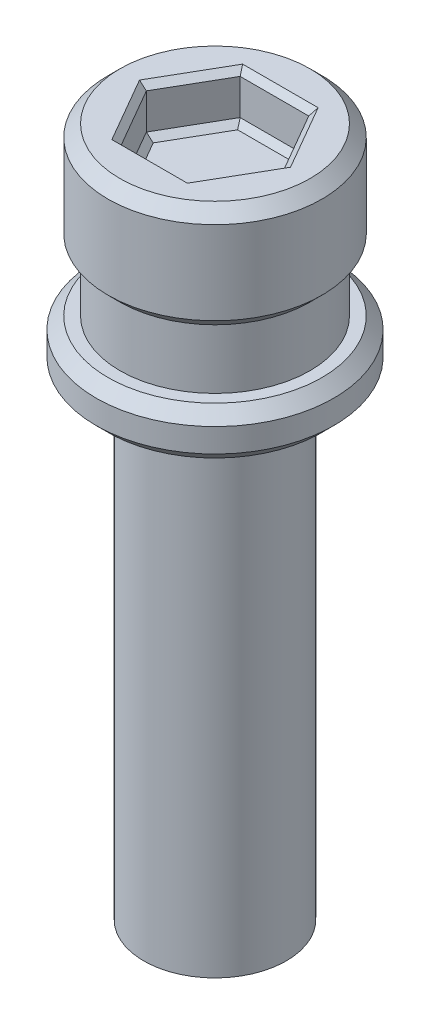
ISO-10303-21;
HEADER;
FILE_DESCRIPTION(('STEP AP214'),'2;1');
FILE_NAME('part.step','',(''),(''),'','','');
FILE_SCHEMA(('AUTOMOTIVE_DESIGN { 1 0 10303 214 1 1 1 1 }'));
ENDSEC;
DATA;
#1=APPLICATION_CONTEXT('core data for automotive mechanical design processes');
#2=APPLICATION_PROTOCOL_DEFINITION('international standard','automotive_design',2000,#1);
#3=PRODUCT_CONTEXT('',#1,'mechanical');
#4=PRODUCT('Part','Part','',(#3));
#5=PRODUCT_RELATED_PRODUCT_CATEGORY('part','',(#4));
#6=PRODUCT_DEFINITION_FORMATION('','',#4);
#7=PRODUCT_DEFINITION_CONTEXT('part definition',#1,'design');
#8=PRODUCT_DEFINITION('design','',#6,#7);
#9=PRODUCT_DEFINITION_SHAPE('','',#8);
#10=(LENGTH_UNIT() NAMED_UNIT(*) SI_UNIT(.MILLI.,.METRE.));
#11=(NAMED_UNIT(*) PLANE_ANGLE_UNIT() SI_UNIT($,.RADIAN.));
#12=(NAMED_UNIT(*) SI_UNIT($,.STERADIAN.) SOLID_ANGLE_UNIT());
#13=UNCERTAINTY_MEASURE_WITH_UNIT(LENGTH_MEASURE(1.E-05),#10,'distance_accuracy_value','');
#14=(GEOMETRIC_REPRESENTATION_CONTEXT(3) GLOBAL_UNCERTAINTY_ASSIGNED_CONTEXT((#13)) GLOBAL_UNIT_ASSIGNED_CONTEXT((#10,
#11,#12)) REPRESENTATION_CONTEXT('',''));
#15=CARTESIAN_POINT('',(0.,0.,0.));
#16=DIRECTION('',(0.,0.,1.));
#17=DIRECTION('',(1.,0.,0.));
#18=AXIS2_PLACEMENT_3D('',#15,#16,#17);
#19=CARTESIAN_POINT('',(0.,4.5,0.));
#20=DIRECTION('',(0.,-1.,0.));
#21=DIRECTION('',(0.,0.,-1.));
#22=AXIS2_PLACEMENT_3D('',#19,#20,#21);
#23=CYLINDRICAL_SURFACE('',#22,4.5);
#24=CARTESIAN_POINT('',(0.,0.500000000000001,0.));
#25=DIRECTION('',(0.,1.,0.));
#26=DIRECTION('',(0.,0.,1.));
#27=AXIS2_PLACEMENT_3D('',#24,#25,#26);
#28=CIRCLE('',#27,4.5);
#29=CARTESIAN_POINT('',(0.,0.500000000000001,4.5));
#30=VERTEX_POINT('',#29);
#31=EDGE_CURVE('E264',#30,#30,#28,.T.);
#32=ORIENTED_EDGE('',*,*,#31,.T.);
#33=EDGE_LOOP('',(#32));
#34=FACE_BOUND('',#33,.T.);
#35=CARTESIAN_POINT('',(0.,3.99999999999999,0.));
#36=DIRECTION('',(0.,1.,0.));
#37=DIRECTION('',(0.,0.,1.));
#38=AXIS2_PLACEMENT_3D('',#35,#36,#37);
#39=CIRCLE('',#38,4.5);
#40=CARTESIAN_POINT('',(0.,3.99999999999999,4.5));
#41=VERTEX_POINT('',#40);
#42=EDGE_CURVE('E261',#41,#41,#39,.F.);
#43=ORIENTED_EDGE('',*,*,#42,.T.);
#44=EDGE_LOOP('',(#43));
#45=FACE_BOUND('',#44,.T.);
#46=ADVANCED_FACE('F33',(#34,#45),#23,.T.);
#47=CARTESIAN_POINT('',(0.,4.5,0.));
#48=DIRECTION('',(0.,1.,0.));
#49=DIRECTION('',(0.,0.,1.));
#50=AXIS2_PLACEMENT_3D('',#47,#48,#49);
#51=PLANE('',#50);
#52=DIRECTION('',(-0.5,0.,0.866025403784439));
#53=VECTOR('',#52,1.);
#54=CARTESIAN_POINT('',(1.65988202392017,4.5,2.625));
#55=LINE('',#54,#53);
#56=CARTESIAN_POINT('',(3.17542648054294,4.5,0.));
#57=VERTEX_POINT('',#56);
#58=CARTESIAN_POINT('',(1.58771324027147,4.5,2.75));
#59=VERTEX_POINT('',#58);
#60=EDGE_CURVE('E166',#57,#59,#55,.T.);
#61=ORIENTED_EDGE('',*,*,#60,.T.);
#62=DIRECTION('',(-1.,0.,0.));
#63=VECTOR('',#62,1.);
#64=CARTESIAN_POINT('',(-1.44337567297407,4.5,2.75));
#65=LINE('',#64,#63);
#66=CARTESIAN_POINT('',(-1.58771324027147,4.5,2.75));
#67=VERTEX_POINT('',#66);
#68=EDGE_CURVE('E182',#59,#67,#65,.T.);
#69=ORIENTED_EDGE('',*,*,#68,.T.);
#70=DIRECTION('',(-0.5,0.,-0.866025403784439));
#71=VECTOR('',#70,1.);
#72=CARTESIAN_POINT('',(-3.10325769689424,4.5,0.125));
#73=LINE('',#72,#71);
#74=CARTESIAN_POINT('',(-3.17542648054294,4.5,0.));
#75=VERTEX_POINT('',#74);
#76=EDGE_CURVE('E180',#67,#75,#73,.T.);
#77=ORIENTED_EDGE('',*,*,#76,.T.);
#78=DIRECTION('',(0.5,0.,-0.866025403784439));
#79=VECTOR('',#78,1.);
#80=CARTESIAN_POINT('',(-1.65988202392017,4.5,-2.625));
#81=LINE('',#80,#79);
#82=CARTESIAN_POINT('',(-1.58771324027147,4.5,-2.75));
#83=VERTEX_POINT('',#82);
#84=EDGE_CURVE('E178',#75,#83,#81,.T.);
#85=ORIENTED_EDGE('',*,*,#84,.T.);
#86=DIRECTION('',(1.,0.,0.));
#87=VECTOR('',#86,1.);
#88=CARTESIAN_POINT('',(1.44337567297406,4.5,-2.75));
#89=LINE('',#88,#87);
#90=CARTESIAN_POINT('',(1.58771324027147,4.5,-2.75));
#91=VERTEX_POINT('',#90);
#92=EDGE_CURVE('E176',#83,#91,#89,.T.);
#93=ORIENTED_EDGE('',*,*,#92,.T.);
#94=DIRECTION('',(0.5,0.,0.866025403784439));
#95=VECTOR('',#94,1.);
#96=CARTESIAN_POINT('',(3.10325769689424,4.5,-0.124999999999999));
#97=LINE('',#96,#95);
#98=EDGE_CURVE('E174',#91,#57,#97,.T.);
#99=ORIENTED_EDGE('',*,*,#98,.T.);
#100=EDGE_LOOP('',(#61,#69,#77,#85,#93,#99));
#101=FACE_BOUND('',#100,.T.);
#102=CARTESIAN_POINT('',(0.,4.5,0.));
#103=DIRECTION('',(0.,1.,0.));
#104=DIRECTION('',(0.,0.,1.));
#105=AXIS2_PLACEMENT_3D('',#102,#103,#104);
#106=CIRCLE('',#105,4.);
#107=CARTESIAN_POINT('',(0.,4.5,4.));
#108=VERTEX_POINT('',#107);
#109=EDGE_CURVE('E258',#108,#108,#106,.T.);
#110=ORIENTED_EDGE('',*,*,#109,.T.);
#111=EDGE_LOOP('',(#110));
#112=FACE_BOUND('',#111,.T.);
#113=ADVANCED_FACE('F352',(#101,#112),#51,.T.);
#114=CARTESIAN_POINT('',(1.44337567297407,2.5,2.5));
#115=DIRECTION('',(0.866025403784439,0.,0.5));
#116=DIRECTION('',(0.5,0.,-0.866025403784439));
#117=AXIS2_PLACEMENT_3D('',#114,#115,#116);
#118=PLANE('',#117);
#119=DIRECTION('',(0.,1.,0.));
#120=VECTOR('',#119,1.);
#121=CARTESIAN_POINT('',(1.44337567297407,2.5,2.5));
#122=LINE('',#121,#120);
#123=CARTESIAN_POINT('',(1.44337567297407,2.75,2.5));
#124=VERTEX_POINT('',#123);
#125=CARTESIAN_POINT('',(1.44337567297407,4.25000000000001,2.5));
#126=VERTEX_POINT('',#125);
#127=EDGE_CURVE('E130',#124,#126,#122,.T.);
#128=ORIENTED_EDGE('',*,*,#127,.T.);
#129=DIRECTION('',(0.5,0.,-0.866025403784439));
#130=VECTOR('',#129,1.);
#131=CARTESIAN_POINT('',(2.88675134594813,4.25000000000001,0.));
#132=LINE('',#131,#130);
#133=CARTESIAN_POINT('',(2.88675134594813,4.25000000000001,0.));
#134=VERTEX_POINT('',#133);
#135=EDGE_CURVE('E137',#126,#134,#132,.T.);
#136=ORIENTED_EDGE('',*,*,#135,.T.);
#137=DIRECTION('',(0.,1.,0.));
#138=VECTOR('',#137,1.);
#139=CARTESIAN_POINT('',(2.88675134594813,2.5,0.));
#140=LINE('',#139,#138);
#141=CARTESIAN_POINT('',(2.88675134594813,2.75,0.));
#142=VERTEX_POINT('',#141);
#143=EDGE_CURVE('E132',#142,#134,#140,.T.);
#144=ORIENTED_EDGE('',*,*,#143,.F.);
#145=DIRECTION('',(-0.5,0.,0.866025403784439));
#146=VECTOR('',#145,1.);
#147=CARTESIAN_POINT('',(1.44337567297407,2.75,2.5));
#148=LINE('',#147,#146);
#149=EDGE_CURVE('E127',#142,#124,#148,.T.);
#150=ORIENTED_EDGE('',*,*,#149,.T.);
#151=EDGE_LOOP('',(#128,#136,#144,#150));
#152=FACE_BOUND('',#151,.T.);
#153=ADVANCED_FACE('F129',(#152),#118,.F.);
#154=CARTESIAN_POINT('',(-1.44337567297407,2.5,2.5));
#155=DIRECTION('',(0.,0.,1.));
#156=DIRECTION('',(1.,0.,0.));
#157=AXIS2_PLACEMENT_3D('',#154,#155,#156);
#158=PLANE('',#157);
#159=DIRECTION('',(0.,1.,0.));
#160=VECTOR('',#159,1.);
#161=CARTESIAN_POINT('',(-1.44337567297407,2.5,2.5));
#162=LINE('',#161,#160);
#163=CARTESIAN_POINT('',(-1.44337567297407,2.75,2.5));
#164=VERTEX_POINT('',#163);
#165=CARTESIAN_POINT('',(-1.44337567297407,4.25000000000001,2.5));
#166=VERTEX_POINT('',#165);
#167=EDGE_CURVE('E150',#164,#166,#162,.T.);
#168=ORIENTED_EDGE('',*,*,#167,.T.);
#169=DIRECTION('',(1.,0.,0.));
#170=VECTOR('',#169,1.);
#171=CARTESIAN_POINT('',(1.44337567297407,4.25000000000001,2.5));
#172=LINE('',#171,#170);
#173=EDGE_CURVE('E148',#166,#126,#172,.T.);
#174=ORIENTED_EDGE('',*,*,#173,.T.);
#175=ORIENTED_EDGE('',*,*,#127,.F.);
#176=DIRECTION('',(-1.,0.,0.));
#177=VECTOR('',#176,1.);
#178=CARTESIAN_POINT('',(-1.44337567297407,2.75,2.5));
#179=LINE('',#178,#177);
#180=EDGE_CURVE('E145',#124,#164,#179,.T.);
#181=ORIENTED_EDGE('',*,*,#180,.T.);
#182=EDGE_LOOP('',(#168,#174,#175,#181));
#183=FACE_BOUND('',#182,.T.);
#184=ADVANCED_FACE('F143',(#183),#158,.F.);
#185=CARTESIAN_POINT('',(-2.88675134594813,2.5,0.));
#186=DIRECTION('',(-0.866025403784439,0.,0.5));
#187=DIRECTION('',(0.5,0.,0.866025403784439));
#188=AXIS2_PLACEMENT_3D('',#185,#186,#187);
#189=PLANE('',#188);
#190=DIRECTION('',(0.,1.,0.));
#191=VECTOR('',#190,1.);
#192=CARTESIAN_POINT('',(-2.88675134594813,2.5,0.));
#193=LINE('',#192,#191);
#194=CARTESIAN_POINT('',(-2.88675134594813,2.75,0.));
#195=VERTEX_POINT('',#194);
#196=CARTESIAN_POINT('',(-2.88675134594813,4.25000000000001,0.));
#197=VERTEX_POINT('',#196);
#198=EDGE_CURVE('E250',#195,#197,#193,.T.);
#199=ORIENTED_EDGE('',*,*,#198,.T.);
#200=DIRECTION('',(0.5,0.,0.866025403784439));
#201=VECTOR('',#200,1.);
#202=CARTESIAN_POINT('',(-1.44337567297407,4.25000000000001,2.5));
#203=LINE('',#202,#201);
#204=EDGE_CURVE('E187',#197,#166,#203,.T.);
#205=ORIENTED_EDGE('',*,*,#204,.T.);
#206=ORIENTED_EDGE('',*,*,#167,.F.);
#207=DIRECTION('',(-0.5,0.,-0.866025403784439));
#208=VECTOR('',#207,1.);
#209=CARTESIAN_POINT('',(-2.88675134594813,2.75,0.));
#210=LINE('',#209,#208);
#211=EDGE_CURVE('E185',#164,#195,#210,.T.);
#212=ORIENTED_EDGE('',*,*,#211,.T.);
#213=EDGE_LOOP('',(#199,#205,#206,#212));
#214=FACE_BOUND('',#213,.T.);
#215=ADVANCED_FACE('F305',(#214),#189,.F.);
#216=CARTESIAN_POINT('',(-1.44337567297407,2.5,-2.5));
#217=DIRECTION('',(-0.866025403784439,0.,-0.5));
#218=DIRECTION('',(-0.5,0.,0.866025403784439));
#219=AXIS2_PLACEMENT_3D('',#216,#217,#218);
#220=PLANE('',#219);
#221=DIRECTION('',(0.,1.,0.));
#222=VECTOR('',#221,1.);
#223=CARTESIAN_POINT('',(-1.44337567297407,2.5,-2.5));
#224=LINE('',#223,#222);
#225=CARTESIAN_POINT('',(-1.44337567297407,2.75,-2.5));
#226=VERTEX_POINT('',#225);
#227=CARTESIAN_POINT('',(-1.44337567297407,4.25000000000001,-2.5));
#228=VERTEX_POINT('',#227);
#229=EDGE_CURVE('E247',#226,#228,#224,.T.);
#230=ORIENTED_EDGE('',*,*,#229,.T.);
#231=DIRECTION('',(-0.5,0.,0.866025403784439));
#232=VECTOR('',#231,1.);
#233=CARTESIAN_POINT('',(-2.88675134594813,4.25000000000001,0.));
#234=LINE('',#233,#232);
#235=EDGE_CURVE('E192',#228,#197,#234,.T.);
#236=ORIENTED_EDGE('',*,*,#235,.T.);
#237=ORIENTED_EDGE('',*,*,#198,.F.);
#238=DIRECTION('',(0.5,0.,-0.866025403784439));
#239=VECTOR('',#238,1.);
#240=CARTESIAN_POINT('',(-1.44337567297407,2.75,-2.5));
#241=LINE('',#240,#239);
#242=EDGE_CURVE('E189',#195,#226,#241,.T.);
#243=ORIENTED_EDGE('',*,*,#242,.T.);
#244=EDGE_LOOP('',(#230,#236,#237,#243));
#245=FACE_BOUND('',#244,.T.);
#246=ADVANCED_FACE('F335',(#245),#220,.F.);
#247=CARTESIAN_POINT('',(1.44337567297406,2.5,-2.5));
#248=DIRECTION('',(0.,0.,-1.));
#249=DIRECTION('',(-1.,0.,0.));
#250=AXIS2_PLACEMENT_3D('',#247,#248,#249);
#251=PLANE('',#250);
#252=DIRECTION('',(0.,1.,0.));
#253=VECTOR('',#252,1.);
#254=CARTESIAN_POINT('',(1.44337567297406,2.5,-2.5));
#255=LINE('',#254,#253);
#256=CARTESIAN_POINT('',(1.44337567297406,2.75,-2.5));
#257=VERTEX_POINT('',#256);
#258=CARTESIAN_POINT('',(1.44337567297406,4.25000000000001,-2.5));
#259=VERTEX_POINT('',#258);
#260=EDGE_CURVE('E244',#257,#259,#255,.T.);
#261=ORIENTED_EDGE('',*,*,#260,.T.);
#262=DIRECTION('',(-1.,0.,0.));
#263=VECTOR('',#262,1.);
#264=CARTESIAN_POINT('',(-1.44337567297407,4.25000000000001,-2.5));
#265=LINE('',#264,#263);
#266=EDGE_CURVE('E196',#259,#228,#265,.T.);
#267=ORIENTED_EDGE('',*,*,#266,.T.);
#268=ORIENTED_EDGE('',*,*,#229,.F.);
#269=DIRECTION('',(1.,0.,0.));
#270=VECTOR('',#269,1.);
#271=CARTESIAN_POINT('',(1.44337567297406,2.75,-2.5));
#272=LINE('',#271,#270);
#273=EDGE_CURVE('E194',#226,#257,#272,.T.);
#274=ORIENTED_EDGE('',*,*,#273,.T.);
#275=EDGE_LOOP('',(#261,#267,#268,#274));
#276=FACE_BOUND('',#275,.T.);
#277=ADVANCED_FACE('F334',(#276),#251,.F.);
#278=CARTESIAN_POINT('',(2.88675134594813,2.5,0.));
#279=DIRECTION('',(0.866025403784439,0.,-0.5));
#280=DIRECTION('',(-0.5,0.,-0.866025403784439));
#281=AXIS2_PLACEMENT_3D('',#278,#279,#280);
#282=PLANE('',#281);
#283=ORIENTED_EDGE('',*,*,#143,.T.);
#284=DIRECTION('',(-0.5,0.,-0.866025403784439));
#285=VECTOR('',#284,1.);
#286=CARTESIAN_POINT('',(1.44337567297406,4.25000000000001,-2.5));
#287=LINE('',#286,#285);
#288=EDGE_CURVE('E138',#134,#259,#287,.T.);
#289=ORIENTED_EDGE('',*,*,#288,.T.);
#290=ORIENTED_EDGE('',*,*,#260,.F.);
#291=DIRECTION('',(0.5,0.,0.866025403784439));
#292=VECTOR('',#291,1.);
#293=CARTESIAN_POINT('',(2.88675134594813,2.75,0.));
#294=LINE('',#293,#292);
#295=EDGE_CURVE('E198',#257,#142,#294,.T.);
#296=ORIENTED_EDGE('',*,*,#295,.T.);
#297=EDGE_LOOP('',(#283,#289,#290,#296));
#298=FACE_BOUND('',#297,.T.);
#299=ADVANCED_FACE('F241',(#298),#282,.F.);
#300=CARTESIAN_POINT('',(0.,2.5,0.));
#301=DIRECTION('',(0.,1.,0.));
#302=DIRECTION('',(0.,0.,1.));
#303=AXIS2_PLACEMENT_3D('',#300,#301,#302);
#304=PLANE('',#303);
#305=DIRECTION('',(-1.,0.,0.));
#306=VECTOR('',#305,1.);
#307=CARTESIAN_POINT('',(0.,2.5,-2.25));
#308=LINE('',#307,#306);
#309=CARTESIAN_POINT('',(1.29903810567666,2.5,-2.25));
#310=VERTEX_POINT('',#309);
#311=CARTESIAN_POINT('',(-1.29903810567666,2.5,-2.25));
#312=VERTEX_POINT('',#311);
#313=EDGE_CURVE('E57',#310,#312,#308,.T.);
#314=ORIENTED_EDGE('',*,*,#313,.T.);
#315=DIRECTION('',(-0.5,0.,0.866025403784439));
#316=VECTOR('',#315,1.);
#317=CARTESIAN_POINT('',(-1.94855715851499,2.5,-1.125));
#318=LINE('',#317,#316);
#319=CARTESIAN_POINT('',(-2.59807621135332,2.5,0.));
#320=VERTEX_POINT('',#319);
#321=EDGE_CURVE('E11',#312,#320,#318,.T.);
#322=ORIENTED_EDGE('',*,*,#321,.T.);
#323=DIRECTION('',(0.5,0.,0.866025403784439));
#324=VECTOR('',#323,1.);
#325=CARTESIAN_POINT('',(-1.94855715851499,2.5,1.125));
#326=LINE('',#325,#324);
#327=CARTESIAN_POINT('',(-1.29903810567666,2.5,2.25));
#328=VERTEX_POINT('',#327);
#329=EDGE_CURVE('E42',#320,#328,#326,.T.);
#330=ORIENTED_EDGE('',*,*,#329,.T.);
#331=DIRECTION('',(1.,0.,0.));
#332=VECTOR('',#331,1.);
#333=CARTESIAN_POINT('',(0.,2.5,2.25));
#334=LINE('',#333,#332);
#335=CARTESIAN_POINT('',(1.29903810567666,2.5,2.25));
#336=VERTEX_POINT('',#335);
#337=EDGE_CURVE('E202',#328,#336,#334,.T.);
#338=ORIENTED_EDGE('',*,*,#337,.T.);
#339=DIRECTION('',(0.5,0.,-0.866025403784439));
#340=VECTOR('',#339,1.);
#341=CARTESIAN_POINT('',(1.94855715851499,2.5,1.125));
#342=LINE('',#341,#340);
#343=CARTESIAN_POINT('',(2.59807621135332,2.5,0.));
#344=VERTEX_POINT('',#343);
#345=EDGE_CURVE('E155',#336,#344,#342,.T.);
#346=ORIENTED_EDGE('',*,*,#345,.T.);
#347=DIRECTION('',(-0.5,0.,-0.866025403784439));
#348=VECTOR('',#347,1.);
#349=CARTESIAN_POINT('',(1.94855715851499,2.5,-1.125));
#350=LINE('',#349,#348);
#351=EDGE_CURVE('E205',#344,#310,#350,.T.);
#352=ORIENTED_EDGE('',*,*,#351,.T.);
#353=EDGE_LOOP('',(#314,#322,#330,#338,#346,#352));
#354=FACE_BOUND('',#353,.T.);
#355=ADVANCED_FACE('F339',(#354),#304,.T.);
#356=CARTESIAN_POINT('',(0.,-2.5,0.));
#357=DIRECTION('',(0.,1.,0.));
#358=DIRECTION('',(0.,0.,1.));
#359=AXIS2_PLACEMENT_3D('',#356,#357,#358);
#360=CYLINDRICAL_SURFACE('',#359,4.);
#361=CARTESIAN_POINT('',(0.,-2.5,0.));
#362=DIRECTION('',(0.,-1.,0.));
#363=DIRECTION('',(0.,0.,-1.));
#364=AXIS2_PLACEMENT_3D('',#361,#362,#363);
#365=CIRCLE('',#364,4.);
#366=CARTESIAN_POINT('',(0.,-2.5,-4.));
#367=VERTEX_POINT('',#366);
#368=EDGE_CURVE('E252',#367,#367,#365,.T.);
#369=ORIENTED_EDGE('',*,*,#368,.F.);
#370=EDGE_LOOP('',(#369));
#371=FACE_BOUND('',#370,.T.);
#372=CARTESIAN_POINT('',(0.,0.,0.));
#373=DIRECTION('',(0.,1.,0.));
#374=DIRECTION('',(0.,0.,1.));
#375=AXIS2_PLACEMENT_3D('',#372,#373,#374);
#376=CIRCLE('',#375,4.);
#377=CARTESIAN_POINT('',(0.,0.,4.));
#378=VERTEX_POINT('',#377);
#379=EDGE_CURVE('E149',#378,#378,#376,.F.);
#380=ORIENTED_EDGE('',*,*,#379,.T.);
#381=EDGE_LOOP('',(#380));
#382=FACE_BOUND('',#381,.T.);
#383=ADVANCED_FACE('F341',(#371,#382),#360,.T.);
#384=CARTESIAN_POINT('',(0.,-4.5,0.));
#385=DIRECTION('',(0.,1.,0.));
#386=DIRECTION('',(0.,0.,1.));
#387=AXIS2_PLACEMENT_3D('',#384,#385,#386);
#388=CYLINDRICAL_SURFACE('',#387,5.);
#389=CARTESIAN_POINT('',(0.,-3.99999999999999,0.));
#390=DIRECTION('',(0.,-1.,0.));
#391=DIRECTION('',(0.,0.,-1.));
#392=AXIS2_PLACEMENT_3D('',#389,#390,#391);
#393=CIRCLE('',#392,5.);
#394=CARTESIAN_POINT('',(0.,-3.99999999999999,-5.));
#395=VERTEX_POINT('',#394);
#396=EDGE_CURVE('E169',#395,#395,#393,.F.);
#397=ORIENTED_EDGE('',*,*,#396,.T.);
#398=EDGE_LOOP('',(#397));
#399=FACE_BOUND('',#398,.T.);
#400=CARTESIAN_POINT('',(0.,-3.,0.));
#401=DIRECTION('',(0.,-1.,0.));
#402=DIRECTION('',(0.,0.,-1.));
#403=AXIS2_PLACEMENT_3D('',#400,#401,#402);
#404=CIRCLE('',#403,5.);
#405=CARTESIAN_POINT('',(0.,-3.,-5.));
#406=VERTEX_POINT('',#405);
#407=EDGE_CURVE('E270',#406,#406,#404,.T.);
#408=ORIENTED_EDGE('',*,*,#407,.T.);
#409=EDGE_LOOP('',(#408));
#410=FACE_BOUND('',#409,.T.);
#411=ADVANCED_FACE('F275',(#399,#410),#388,.T.);
#412=CARTESIAN_POINT('',(0.,-4.5,0.));
#413=DIRECTION('',(0.,-1.,0.));
#414=DIRECTION('',(0.,0.,-1.));
#415=AXIS2_PLACEMENT_3D('',#412,#413,#414);
#416=PLANE('',#415);
#417=CARTESIAN_POINT('',(0.,-4.5,0.));
#418=DIRECTION('',(0.,-1.,0.));
#419=DIRECTION('',(0.,0.,-1.));
#420=AXIS2_PLACEMENT_3D('',#417,#418,#419);
#421=CIRCLE('',#420,4.5);
#422=CARTESIAN_POINT('',(0.,-4.5,-4.5));
#423=VERTEX_POINT('',#422);
#424=EDGE_CURVE('E267',#423,#423,#421,.T.);
#425=ORIENTED_EDGE('',*,*,#424,.T.);
#426=EDGE_LOOP('',(#425));
#427=FACE_BOUND('',#426,.T.);
#428=CARTESIAN_POINT('',(0.,-4.5,0.));
#429=DIRECTION('',(0.,-1.,0.));
#430=DIRECTION('',(0.,0.,-1.));
#431=AXIS2_PLACEMENT_3D('',#428,#429,#430);
#432=CIRCLE('',#431,3.);
#433=CARTESIAN_POINT('',(0.,-4.5,-3.));
#434=VERTEX_POINT('',#433);
#435=EDGE_CURVE('E225',#434,#434,#432,.T.);
#436=ORIENTED_EDGE('',*,*,#435,.F.);
#437=EDGE_LOOP('',(#436));
#438=FACE_BOUND('',#437,.T.);
#439=ADVANCED_FACE('F286',(#427,#438),#416,.T.);
#440=CARTESIAN_POINT('',(0.,-2.5,0.));
#441=DIRECTION('',(0.,-1.,0.));
#442=DIRECTION('',(0.,0.,-1.));
#443=AXIS2_PLACEMENT_3D('',#440,#441,#442);
#444=PLANE('',#443);
#445=CARTESIAN_POINT('',(0.,-2.5,0.));
#446=DIRECTION('',(0.,-1.,0.));
#447=DIRECTION('',(0.,0.,-1.));
#448=AXIS2_PLACEMENT_3D('',#445,#446,#447);
#449=CIRCLE('',#448,4.49999999999999);
#450=CARTESIAN_POINT('',(0.,-2.5,-4.49999999999999));
#451=VERTEX_POINT('',#450);
#452=EDGE_CURVE('E164',#451,#451,#449,.F.);
#453=ORIENTED_EDGE('',*,*,#452,.T.);
#454=EDGE_LOOP('',(#453));
#455=FACE_BOUND('',#454,.T.);
#456=ORIENTED_EDGE('',*,*,#368,.T.);
#457=EDGE_LOOP('',(#456));
#458=FACE_BOUND('',#457,.T.);
#459=ADVANCED_FACE('F289',(#455,#458),#444,.F.);
#460=CARTESIAN_POINT('',(0.,-24.5,0.));
#461=DIRECTION('',(0.,1.,0.));
#462=DIRECTION('',(0.,0.,1.));
#463=AXIS2_PLACEMENT_3D('',#460,#461,#462);
#464=CYLINDRICAL_SURFACE('',#463,3.);
#465=CARTESIAN_POINT('',(0.,-24.5,0.));
#466=DIRECTION('',(0.,-1.,0.));
#467=DIRECTION('',(0.,0.,-1.));
#468=AXIS2_PLACEMENT_3D('',#465,#466,#467);
#469=CIRCLE('',#468,3.);
#470=CARTESIAN_POINT('',(0.,-24.5,-3.));
#471=VERTEX_POINT('',#470);
#472=EDGE_CURVE('E294',#471,#471,#469,.T.);
#473=ORIENTED_EDGE('',*,*,#472,.F.);
#474=EDGE_LOOP('',(#473));
#475=FACE_BOUND('',#474,.T.);
#476=ORIENTED_EDGE('',*,*,#435,.T.);
#477=EDGE_LOOP('',(#476));
#478=FACE_BOUND('',#477,.T.);
#479=ADVANCED_FACE('F448',(#475,#478),#464,.T.);
#480=CARTESIAN_POINT('',(0.,-24.5,0.));
#481=DIRECTION('',(0.,-1.,0.));
#482=DIRECTION('',(0.,0.,-1.));
#483=AXIS2_PLACEMENT_3D('',#480,#481,#482);
#484=PLANE('',#483);
#485=ORIENTED_EDGE('',*,*,#472,.T.);
#486=EDGE_LOOP('',(#485));
#487=FACE_BOUND('',#486,.T.);
#488=ADVANCED_FACE('F366',(#487),#484,.T.);
#489=CARTESIAN_POINT('',(0.,4.5,0.));
#490=DIRECTION('',(0.,-1.,0.));
#491=DIRECTION('',(0.,0.,-1.));
#492=AXIS2_PLACEMENT_3D('',#489,#490,#491);
#493=CONICAL_SURFACE('',#492,4.,0.785398163397443);
#494=ORIENTED_EDGE('',*,*,#42,.F.);
#495=EDGE_LOOP('',(#494));
#496=FACE_BOUND('',#495,.T.);
#497=ORIENTED_EDGE('',*,*,#109,.F.);
#498=EDGE_LOOP('',(#497));
#499=FACE_BOUND('',#498,.T.);
#500=ADVANCED_FACE('F363',(#496,#499),#493,.T.);
#501=CARTESIAN_POINT('',(0.,0.500000000000001,0.));
#502=DIRECTION('',(0.,1.,0.));
#503=DIRECTION('',(0.,0.,1.));
#504=AXIS2_PLACEMENT_3D('',#501,#502,#503);
#505=CONICAL_SURFACE('',#504,4.5,0.785398163397453);
#506=ORIENTED_EDGE('',*,*,#379,.F.);
#507=EDGE_LOOP('',(#506));
#508=FACE_BOUND('',#507,.T.);
#509=ORIENTED_EDGE('',*,*,#31,.F.);
#510=EDGE_LOOP('',(#509));
#511=FACE_BOUND('',#510,.T.);
#512=ADVANCED_FACE('F282',(#508,#511),#505,.T.);
#513=CARTESIAN_POINT('',(0.,-4.5,0.));
#514=DIRECTION('',(0.,1.,0.));
#515=DIRECTION('',(0.,0.,1.));
#516=AXIS2_PLACEMENT_3D('',#513,#514,#515);
#517=CONICAL_SURFACE('',#516,4.5,0.785398163397445);
#518=ORIENTED_EDGE('',*,*,#396,.F.);
#519=EDGE_LOOP('',(#518));
#520=FACE_BOUND('',#519,.T.);
#521=ORIENTED_EDGE('',*,*,#424,.F.);
#522=EDGE_LOOP('',(#521));
#523=FACE_BOUND('',#522,.T.);
#524=ADVANCED_FACE('F278',(#520,#523),#517,.T.);
#525=CARTESIAN_POINT('',(0.,-3.,0.));
#526=DIRECTION('',(0.,-1.,0.));
#527=DIRECTION('',(0.,0.,-1.));
#528=AXIS2_PLACEMENT_3D('',#525,#526,#527);
#529=CONICAL_SURFACE('',#528,5.,0.785398163397452);
#530=ORIENTED_EDGE('',*,*,#452,.F.);
#531=EDGE_LOOP('',(#530));
#532=FACE_BOUND('',#531,.T.);
#533=ORIENTED_EDGE('',*,*,#407,.F.);
#534=EDGE_LOOP('',(#533));
#535=FACE_BOUND('',#534,.T.);
#536=ADVANCED_FACE('F281',(#532,#535),#529,.T.);
#537=CARTESIAN_POINT('',(1.44337567297406,4.25000000000001,-2.5));
#538=DIRECTION('',(0.,0.707106781186553,0.707106781186542));
#539=DIRECTION('',(1.,0.,0.));
#540=AXIS2_PLACEMENT_3D('',#537,#538,#539);
#541=PLANE('',#540);
#542=DIRECTION('',(-0.377964473009231,-0.654653670707971,0.654653670707981));
#543=VECTOR('',#542,1.);
#544=CARTESIAN_POINT('',(1.44337567297406,4.25000000000001,-2.5));
#545=LINE('',#544,#543);
#546=EDGE_CURVE('E219',#91,#259,#545,.T.);
#547=ORIENTED_EDGE('',*,*,#546,.F.);
#548=ORIENTED_EDGE('',*,*,#92,.F.);
#549=DIRECTION('',(0.37796447300923,-0.654653670707972,0.654653670707981));
#550=VECTOR('',#549,1.);
#551=CARTESIAN_POINT('',(-1.44337567297407,4.25000000000001,-2.5));
#552=LINE('',#551,#550);
#553=EDGE_CURVE('E222',#228,#83,#552,.F.);
#554=ORIENTED_EDGE('',*,*,#553,.F.);
#555=ORIENTED_EDGE('',*,*,#266,.F.);
#556=EDGE_LOOP('',(#547,#548,#554,#555));
#557=FACE_BOUND('',#556,.T.);
#558=ADVANCED_FACE('F331',(#557),#541,.T.);
#559=CARTESIAN_POINT('',(-1.44337567297407,4.25000000000001,-2.5));
#560=DIRECTION('',(0.61237243569579,0.707106781186553,0.353553390593271));
#561=DIRECTION('',(0.5,0.,-0.866025403784439));
#562=AXIS2_PLACEMENT_3D('',#559,#560,#561);
#563=PLANE('',#562);
#564=ORIENTED_EDGE('',*,*,#553,.T.);
#565=ORIENTED_EDGE('',*,*,#84,.F.);
#566=DIRECTION('',(0.755928946018459,-0.654653670707971,0.));
#567=VECTOR('',#566,1.);
#568=CARTESIAN_POINT('',(-2.88675134594813,4.25000000000001,0.));
#569=LINE('',#568,#567);
#570=EDGE_CURVE('E216',#197,#75,#569,.F.);
#571=ORIENTED_EDGE('',*,*,#570,.F.);
#572=ORIENTED_EDGE('',*,*,#235,.F.);
#573=EDGE_LOOP('',(#564,#565,#571,#572));
#574=FACE_BOUND('',#573,.T.);
#575=ADVANCED_FACE('F311',(#574),#563,.T.);
#576=CARTESIAN_POINT('',(2.88675134594813,4.25000000000001,0.));
#577=DIRECTION('',(-0.612372435695789,0.707106781186553,0.353553390593271));
#578=DIRECTION('',(0.5,0.,0.866025403784439));
#579=AXIS2_PLACEMENT_3D('',#576,#577,#578);
#580=PLANE('',#579);
#581=ORIENTED_EDGE('',*,*,#546,.T.);
#582=ORIENTED_EDGE('',*,*,#288,.F.);
#583=DIRECTION('',(-0.755928946018459,-0.654653670707971,0.));
#584=VECTOR('',#583,1.);
#585=CARTESIAN_POINT('',(2.88675134594813,4.25000000000001,0.));
#586=LINE('',#585,#584);
#587=EDGE_CURVE('E213',#57,#134,#586,.T.);
#588=ORIENTED_EDGE('',*,*,#587,.F.);
#589=ORIENTED_EDGE('',*,*,#98,.F.);
#590=EDGE_LOOP('',(#581,#582,#588,#589));
#591=FACE_BOUND('',#590,.T.);
#592=ADVANCED_FACE('F327',(#591),#580,.T.);
#593=CARTESIAN_POINT('',(-2.88675134594813,4.25000000000001,0.));
#594=DIRECTION('',(0.61237243569579,0.707106781186553,-0.353553390593271));
#595=DIRECTION('',(-0.5,0.,-0.866025403784439));
#596=AXIS2_PLACEMENT_3D('',#593,#594,#595);
#597=PLANE('',#596);
#598=ORIENTED_EDGE('',*,*,#570,.T.);
#599=ORIENTED_EDGE('',*,*,#76,.F.);
#600=DIRECTION('',(0.37796447300923,-0.654653670707971,-0.654653670707981));
#601=VECTOR('',#600,1.);
#602=CARTESIAN_POINT('',(-1.44337567297407,4.25000000000001,2.5));
#603=LINE('',#602,#601);
#604=EDGE_CURVE('E211',#166,#67,#603,.F.);
#605=ORIENTED_EDGE('',*,*,#604,.F.);
#606=ORIENTED_EDGE('',*,*,#204,.F.);
#607=EDGE_LOOP('',(#598,#599,#605,#606));
#608=FACE_BOUND('',#607,.T.);
#609=ADVANCED_FACE('F315',(#608),#597,.T.);
#610=CARTESIAN_POINT('',(1.44337567297407,4.25000000000001,2.5));
#611=DIRECTION('',(-0.61237243569579,0.707106781186553,-0.353553390593271));
#612=DIRECTION('',(-0.5,0.,0.866025403784439));
#613=AXIS2_PLACEMENT_3D('',#610,#611,#612);
#614=PLANE('',#613);
#615=ORIENTED_EDGE('',*,*,#587,.T.);
#616=ORIENTED_EDGE('',*,*,#135,.F.);
#617=DIRECTION('',(0.377964473009229,0.654653670707972,0.654653670707982));
#618=VECTOR('',#617,1.);
#619=CARTESIAN_POINT('',(1.0309826235529,3.53571428571429,1.78571428571428));
#620=LINE('',#619,#618);
#621=EDGE_CURVE('E209',#59,#126,#620,.F.);
#622=ORIENTED_EDGE('',*,*,#621,.F.);
#623=ORIENTED_EDGE('',*,*,#60,.F.);
#624=EDGE_LOOP('',(#615,#616,#622,#623));
#625=FACE_BOUND('',#624,.T.);
#626=ADVANCED_FACE('F323',(#625),#614,.T.);
#627=CARTESIAN_POINT('',(-1.44337567297407,4.25000000000001,2.5));
#628=DIRECTION('',(0.,0.707106781186553,-0.707106781186542));
#629=DIRECTION('',(-1.,0.,0.));
#630=AXIS2_PLACEMENT_3D('',#627,#628,#629);
#631=PLANE('',#630);
#632=ORIENTED_EDGE('',*,*,#604,.T.);
#633=ORIENTED_EDGE('',*,*,#68,.F.);
#634=ORIENTED_EDGE('',*,*,#621,.T.);
#635=ORIENTED_EDGE('',*,*,#173,.F.);
#636=EDGE_LOOP('',(#632,#633,#634,#635));
#637=FACE_BOUND('',#636,.T.);
#638=ADVANCED_FACE('F318',(#637),#631,.T.);
#639=CARTESIAN_POINT('',(1.94855715851499,2.5,1.125));
#640=DIRECTION('',(0.612372435695795,-0.707106781186547,0.353553390593274));
#641=DIRECTION('',(0.5,0.,-0.866025403784439));
#642=AXIS2_PLACEMENT_3D('',#639,#640,#641);
#643=PLANE('',#642);
#644=DIRECTION('',(-0.377964473009226,-0.654653670707977,-0.654653670707977));
#645=VECTOR('',#644,1.);
#646=CARTESIAN_POINT('',(1.11346123343714,2.17857142857143,1.92857142857143));
#647=LINE('',#646,#645);
#648=EDGE_CURVE('E154',#124,#336,#647,.T.);
#649=ORIENTED_EDGE('',*,*,#648,.F.);
#650=ORIENTED_EDGE('',*,*,#149,.F.);
#651=DIRECTION('',(-0.755928946018454,-0.654653670707978,0.));
#652=VECTOR('',#651,1.);
#653=CARTESIAN_POINT('',(2.22692246687427,2.17857142857143,0.));
#654=LINE('',#653,#652);
#655=EDGE_CURVE('E37',#344,#142,#654,.F.);
#656=ORIENTED_EDGE('',*,*,#655,.F.);
#657=ORIENTED_EDGE('',*,*,#345,.F.);
#658=EDGE_LOOP('',(#649,#650,#656,#657));
#659=FACE_BOUND('',#658,.T.);
#660=ADVANCED_FACE('F35',(#659),#643,.F.);
#661=CARTESIAN_POINT('',(1.94855715851499,2.5,-1.125));
#662=DIRECTION('',(0.612372435695795,-0.707106781186547,-0.353553390593274));
#663=DIRECTION('',(-0.5,0.,-0.866025403784439));
#664=AXIS2_PLACEMENT_3D('',#661,#662,#663);
#665=PLANE('',#664);
#666=ORIENTED_EDGE('',*,*,#655,.T.);
#667=ORIENTED_EDGE('',*,*,#295,.F.);
#668=DIRECTION('',(-0.377964473009227,-0.654653670707978,0.654653670707977));
#669=VECTOR('',#668,1.);
#670=CARTESIAN_POINT('',(1.11346123343714,2.17857142857143,-1.92857142857143));
#671=LINE('',#670,#669);
#672=EDGE_CURVE('E158',#310,#257,#671,.F.);
#673=ORIENTED_EDGE('',*,*,#672,.F.);
#674=ORIENTED_EDGE('',*,*,#351,.F.);
#675=EDGE_LOOP('',(#666,#667,#673,#674));
#676=FACE_BOUND('',#675,.T.);
#677=ADVANCED_FACE('F238',(#676),#665,.F.);
#678=CARTESIAN_POINT('',(0.,2.5,2.25));
#679=DIRECTION('',(0.,-0.707106781186547,0.707106781186547));
#680=DIRECTION('',(1.,0.,0.));
#681=AXIS2_PLACEMENT_3D('',#678,#679,#680);
#682=PLANE('',#681);
#683=ORIENTED_EDGE('',*,*,#648,.T.);
#684=ORIENTED_EDGE('',*,*,#337,.F.);
#685=DIRECTION('',(-0.377964473009227,0.654653670707977,0.654653670707977));
#686=VECTOR('',#685,1.);
#687=CARTESIAN_POINT('',(-1.11346123343714,2.17857142857143,1.92857142857143));
#688=LINE('',#687,#686);
#689=EDGE_CURVE('E162',#164,#328,#688,.F.);
#690=ORIENTED_EDGE('',*,*,#689,.F.);
#691=ORIENTED_EDGE('',*,*,#180,.F.);
#692=EDGE_LOOP('',(#683,#684,#690,#691));
#693=FACE_BOUND('',#692,.T.);
#694=ADVANCED_FACE('F160',(#693),#682,.F.);
#695=CARTESIAN_POINT('',(0.,2.5,-2.25));
#696=DIRECTION('',(0.,-0.707106781186547,-0.707106781186548));
#697=DIRECTION('',(-1.,0.,0.));
#698=AXIS2_PLACEMENT_3D('',#695,#696,#697);
#699=PLANE('',#698);
#700=ORIENTED_EDGE('',*,*,#672,.T.);
#701=ORIENTED_EDGE('',*,*,#273,.F.);
#702=DIRECTION('',(0.377964473009228,-0.654653670707977,0.654653670707977));
#703=VECTOR('',#702,1.);
#704=CARTESIAN_POINT('',(-1.11346123343714,2.17857142857143,-1.92857142857143));
#705=LINE('',#704,#703);
#706=EDGE_CURVE('E227',#312,#226,#705,.F.);
#707=ORIENTED_EDGE('',*,*,#706,.F.);
#708=ORIENTED_EDGE('',*,*,#313,.F.);
#709=EDGE_LOOP('',(#700,#701,#707,#708));
#710=FACE_BOUND('',#709,.T.);
#711=ADVANCED_FACE('F234',(#710),#699,.F.);
#712=CARTESIAN_POINT('',(-1.94855715851499,2.5,1.125));
#713=DIRECTION('',(-0.612372435695795,-0.707106781186547,0.353553390593274));
#714=DIRECTION('',(0.5,0.,0.866025403784439));
#715=AXIS2_PLACEMENT_3D('',#712,#713,#714);
#716=PLANE('',#715);
#717=ORIENTED_EDGE('',*,*,#689,.T.);
#718=ORIENTED_EDGE('',*,*,#329,.F.);
#719=DIRECTION('',(-0.755928946018454,0.654653670707977,0.));
#720=VECTOR('',#719,1.);
#721=CARTESIAN_POINT('',(-2.22692246687427,2.17857142857143,0.));
#722=LINE('',#721,#720);
#723=EDGE_CURVE('E50',#195,#320,#722,.F.);
#724=ORIENTED_EDGE('',*,*,#723,.F.);
#725=ORIENTED_EDGE('',*,*,#211,.F.);
#726=EDGE_LOOP('',(#717,#718,#724,#725));
#727=FACE_BOUND('',#726,.T.);
#728=ADVANCED_FACE('F338',(#727),#716,.F.);
#729=CARTESIAN_POINT('',(-1.94855715851499,2.5,-1.125));
#730=DIRECTION('',(-0.612372435695795,-0.707106781186547,-0.353553390593274));
#731=DIRECTION('',(-0.5,0.,0.866025403784439));
#732=AXIS2_PLACEMENT_3D('',#729,#730,#731);
#733=PLANE('',#732);
#734=ORIENTED_EDGE('',*,*,#706,.T.);
#735=ORIENTED_EDGE('',*,*,#242,.F.);
#736=ORIENTED_EDGE('',*,*,#723,.T.);
#737=ORIENTED_EDGE('',*,*,#321,.F.);
#738=EDGE_LOOP('',(#734,#735,#736,#737));
#739=FACE_BOUND('',#738,.T.);
#740=ADVANCED_FACE('F336',(#739),#733,.F.);
#741=CLOSED_SHELL('',(#46,#113,#153,#184,#215,#246,#277,#299,#355,#383,#411,#439,#459,#479,#488,
#500,#512,#524,#536,#558,#575,#592,#609,#626,#638,#660,#677,#694,#711,#728,#740));
#742=MANIFOLD_SOLID_BREP('B2',#741);
#743=ADVANCED_BREP_SHAPE_REPRESENTATION('',(#18,#742),#14);
#744=SHAPE_DEFINITION_REPRESENTATION(#9,#743);
ENDSEC;
END-ISO-10303-21;
